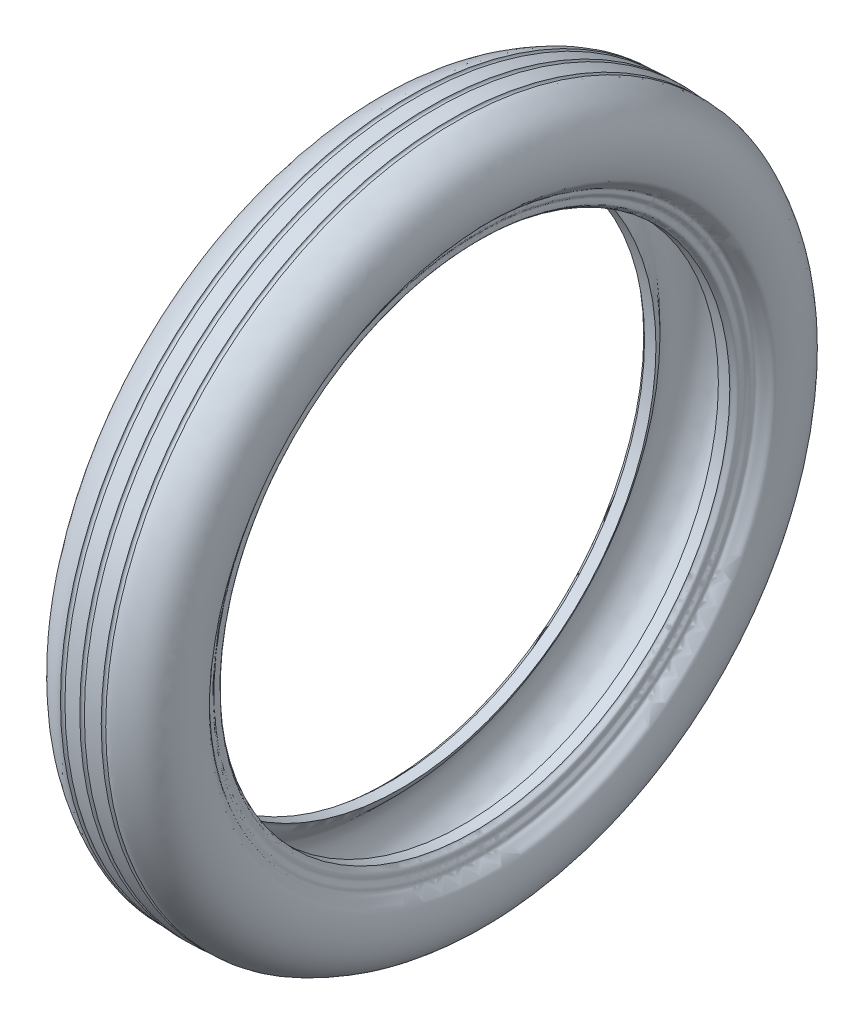
ISO-10303-21;
HEADER;
FILE_DESCRIPTION(('STEP AP214'),'2;1');
FILE_NAME('part.step','',(''),(''),'','','');
FILE_SCHEMA(('AUTOMOTIVE_DESIGN { 1 0 10303 214 1 1 1 1 }'));
ENDSEC;
DATA;
#1=APPLICATION_CONTEXT('core data for automotive mechanical design processes');
#2=APPLICATION_PROTOCOL_DEFINITION('international standard','automotive_design',2000,#1);
#3=PRODUCT_CONTEXT('',#1,'mechanical');
#4=PRODUCT('Part','Part','',(#3));
#5=PRODUCT_RELATED_PRODUCT_CATEGORY('part','',(#4));
#6=PRODUCT_DEFINITION_FORMATION('','',#4);
#7=PRODUCT_DEFINITION_CONTEXT('part definition',#1,'design');
#8=PRODUCT_DEFINITION('design','',#6,#7);
#9=PRODUCT_DEFINITION_SHAPE('','',#8);
#10=(LENGTH_UNIT() NAMED_UNIT(*) SI_UNIT(.MILLI.,.METRE.));
#11=(NAMED_UNIT(*) PLANE_ANGLE_UNIT() SI_UNIT($,.RADIAN.));
#12=(NAMED_UNIT(*) SI_UNIT($,.STERADIAN.) SOLID_ANGLE_UNIT());
#13=UNCERTAINTY_MEASURE_WITH_UNIT(LENGTH_MEASURE(1.E-05),#10,'distance_accuracy_value','');
#14=(GEOMETRIC_REPRESENTATION_CONTEXT(3) GLOBAL_UNCERTAINTY_ASSIGNED_CONTEXT((#13)) GLOBAL_UNIT_ASSIGNED_CONTEXT((#10,
#11,#12)) REPRESENTATION_CONTEXT('',''));
#15=CARTESIAN_POINT('',(0.,0.,0.));
#16=DIRECTION('',(0.,0.,1.));
#17=DIRECTION('',(1.,0.,0.));
#18=AXIS2_PLACEMENT_3D('',#15,#16,#17);
#19=CARTESIAN_POINT('',(-24.8172630139917,203.,0.));
#20=CARTESIAN_POINT('',(-27.2283998288289,205.06391431928,0.));
#21=CARTESIAN_POINT('',(-28.5496427344952,210.327625908058,0.));
#22=CARTESIAN_POINT('',(-33.6712545353592,215.019378984169,0.));
#23=CARTESIAN_POINT('',(-37.7772976660351,219.010363555149,0.));
#24=CARTESIAN_POINT('',(-42.2633577257313,223.062020269606,0.));
#25=CARTESIAN_POINT('',(-45.1671204187017,229.55393791157,0.));
#26=CARTESIAN_POINT('',(-48.0286654197166,236.65779205585,0.));
#27=CARTESIAN_POINT('',(-47.8879674715827,244.882513096217,0.));
#28=CARTESIAN_POINT('',(-46.3948773163548,254.057111445877,0.));
#29=CARTESIAN_POINT('',(-40.3486929351291,261.403587543646,0.));
#30=CARTESIAN_POINT('',(-33.851481321555,268.81086706887,0.));
#31=CARTESIAN_POINT('',(-25.2444175261157,271.404992130535,0.));
#32=CARTESIAN_POINT('',(-16.7423312191855,273.18641912113,0.));
#33=CARTESIAN_POINT('',(-10.1405547550226,273.463220362378,0.));
#34=CARTESIAN_POINT('',(-4.54429512443643,274.014061695448,0.));
#35=CARTESIAN_POINT('',(-1.75340207589833,273.445280920895,0.));
#36=CARTESIAN_POINT('',(0.,273.651830628835,0.));
#37=B_SPLINE_CURVE_WITH_KNOTS('',3,(#19,#20,#21,#22,#23,#24,#25,#26,#27,#28,#29,#30,#31,#32,#33,
#34,#35,#36),.UNSPECIFIED.,.F.,.F.,(4,1,1,1,1,1,1,1,1,1,1,1,1,1,1,4),(0.,0.0822330624444425,
0.137617146698626,0.183009302880853,0.237253629031035,0.297469874379483,0.371716047539101,
0.44060468979368,0.515818013596818,0.616103802574389,0.690267434104086,0.776013817716258,
0.849380324821276,0.924772592656254,0.952990480004338,1.),.UNSPECIFIED.);
#38=CARTESIAN_POINT('',(-102.722911074857,0.,0.));
#39=DIRECTION('',(-1.,0.,0.));
#40=AXIS1_PLACEMENT('',#38,#39);
#41=SURFACE_OF_REVOLUTION('',#37,#40);
#42=CARTESIAN_POINT('',(0.,0.,0.));
#43=DIRECTION('',(1.,0.,0.));
#44=DIRECTION('',(0.,0.,-1.));
#45=AXIS2_PLACEMENT_3D('',#42,#43,#44);
#46=CIRCLE('',#45,273.651830628835);
#47=CARTESIAN_POINT('',(0.,0.,-273.651830628835));
#48=VERTEX_POINT('',#47);
#49=EDGE_CURVE('E10',#48,#48,#46,.T.);
#50=ORIENTED_EDGE('',*,*,#49,.T.);
#51=EDGE_LOOP('',(#50));
#52=FACE_BOUND('',#51,.T.);
#53=CARTESIAN_POINT('',(-24.8172630139917,0.,0.));
#54=DIRECTION('',(1.,0.,0.));
#55=DIRECTION('',(0.,0.,-1.));
#56=AXIS2_PLACEMENT_3D('',#53,#54,#55);
#57=CIRCLE('',#56,203.);
#58=CARTESIAN_POINT('',(-24.8172630139917,0.,-203.));
#59=VERTEX_POINT('',#58);
#60=EDGE_CURVE('E73',#59,#59,#57,.T.);
#61=ORIENTED_EDGE('',*,*,#60,.F.);
#62=EDGE_LOOP('',(#61));
#63=FACE_BOUND('',#62,.T.);
#64=ADVANCED_FACE('F35',(#52,#63),#41,.T.);
#65=CARTESIAN_POINT('',(0.,273.651830628835,0.));
#66=CARTESIAN_POINT('',(1.7534020758983,273.445280920895,0.));
#67=CARTESIAN_POINT('',(4.5442951244364,274.014061695448,0.));
#68=CARTESIAN_POINT('',(10.1405547550225,273.463220362378,0.));
#69=CARTESIAN_POINT('',(16.7423312191854,273.186419121129,0.));
#70=CARTESIAN_POINT('',(25.2444175261157,271.404992130535,0.));
#71=CARTESIAN_POINT('',(33.851481321555,268.81086706887,0.));
#72=CARTESIAN_POINT('',(40.3486929351291,261.403587543646,0.));
#73=CARTESIAN_POINT('',(46.3948773163547,254.057111445877,0.));
#74=CARTESIAN_POINT('',(47.8879674715826,244.882513096217,0.));
#75=CARTESIAN_POINT('',(48.0286654197166,236.65779205585,0.));
#76=CARTESIAN_POINT('',(45.1671204187017,229.55393791157,0.));
#77=CARTESIAN_POINT('',(42.2633577257312,223.062020269606,0.));
#78=CARTESIAN_POINT('',(37.7772976660351,219.010363555149,0.));
#79=CARTESIAN_POINT('',(33.6712545353592,215.019378984169,0.));
#80=CARTESIAN_POINT('',(28.5496427344952,210.327625908058,0.));
#81=CARTESIAN_POINT('',(27.2283998288289,205.06391431928,0.));
#82=CARTESIAN_POINT('',(24.8172630139916,203.,0.));
#83=B_SPLINE_CURVE_WITH_KNOTS('',3,(#65,#66,#67,#68,#69,#70,#71,#72,#73,#74,#75,#76,#77,#78,#79,
#80,#81,#82),.UNSPECIFIED.,.F.,.F.,(4,1,1,1,1,1,1,1,1,1,1,1,1,1,1,4),(0.,0.0470095199956621,
0.0752274073437459,0.150619675178724,0.223986182283742,0.309732565895914,0.383896197425612,
0.484181986403182,0.55939531020632,0.628283952460899,0.702530125620518,0.762746370968965,
0.816990697119147,0.862382853301374,0.917766937555557,1.),.UNSPECIFIED.);
#84=CARTESIAN_POINT('',(-102.722911074857,0.,0.));
#85=DIRECTION('',(-1.,0.,0.));
#86=AXIS1_PLACEMENT('',#84,#85);
#87=SURFACE_OF_REVOLUTION('',#83,#86);
#88=CARTESIAN_POINT('',(24.8172630139917,0.,0.));
#89=DIRECTION('',(1.,0.,0.));
#90=DIRECTION('',(0.,0.,-1.));
#91=AXIS2_PLACEMENT_3D('',#88,#89,#90);
#92=CIRCLE('',#91,203.);
#93=CARTESIAN_POINT('',(24.8172630139917,0.,-203.));
#94=VERTEX_POINT('',#93);
#95=EDGE_CURVE('E42',#94,#94,#92,.T.);
#96=ORIENTED_EDGE('',*,*,#95,.T.);
#97=EDGE_LOOP('',(#96));
#98=FACE_BOUND('',#97,.T.);
#99=ORIENTED_EDGE('',*,*,#49,.F.);
#100=EDGE_LOOP('',(#99));
#101=FACE_BOUND('',#100,.T.);
#102=ADVANCED_FACE('F120',(#98,#101),#87,.T.);
#103=CARTESIAN_POINT('',(-102.722911074857,0.,0.));
#104=DIRECTION('',(-1.,0.,0.));
#105=DIRECTION('',(0.,0.,-1.));
#106=AXIS2_PLACEMENT_3D('',#103,#104,#105);
#107=CYLINDRICAL_SURFACE('',#106,203.);
#108=CARTESIAN_POINT('',(33.9052748219322,0.,0.));
#109=DIRECTION('',(1.,0.,0.));
#110=DIRECTION('',(0.,0.,-1.));
#111=AXIS2_PLACEMENT_3D('',#108,#109,#110);
#112=CIRCLE('',#111,203.);
#113=CARTESIAN_POINT('',(33.9052748219322,0.,-203.));
#114=VERTEX_POINT('',#113);
#115=EDGE_CURVE('E46',#114,#114,#112,.T.);
#116=ORIENTED_EDGE('',*,*,#115,.T.);
#117=EDGE_LOOP('',(#116));
#118=FACE_BOUND('',#117,.T.);
#119=ORIENTED_EDGE('',*,*,#95,.F.);
#120=EDGE_LOOP('',(#119));
#121=FACE_BOUND('',#120,.T.);
#122=ADVANCED_FACE('F117',(#118,#121),#107,.F.);
#123=CARTESIAN_POINT('',(33.9052748219323,203.,0.));
#124=CARTESIAN_POINT('',(34.4514477122976,204.223315441255,0.));
#125=CARTESIAN_POINT('',(38.405176851135,205.210772848352,0.));
#126=CARTESIAN_POINT('',(37.5895196663085,208.702454770499,0.));
#127=CARTESIAN_POINT('',(37.3176730115443,211.637363166268,0.));
#128=CARTESIAN_POINT('',(40.3679293440638,213.465220786409,0.));
#129=CARTESIAN_POINT('',(39.0660676586276,217.086806756293,0.));
#130=CARTESIAN_POINT('',(42.5299588621192,218.987124675277,0.));
#131=CARTESIAN_POINT('',(44.4812031460707,222.024976144124,0.));
#132=CARTESIAN_POINT('',(48.1613248996428,224.664233070907,0.));
#133=CARTESIAN_POINT('',(49.3373100798012,231.297261903147,0.));
#134=CARTESIAN_POINT('',(50.5659703704679,239.217588361253,0.));
#135=CARTESIAN_POINT('',(49.5419089182548,249.309832870114,0.));
#136=CARTESIAN_POINT('',(46.4257794125868,258.785832909676,0.));
#137=CARTESIAN_POINT('',(40.6849116029119,266.454028141102,0.));
#138=CARTESIAN_POINT('',(33.8688282793654,271.544671240841,0.));
#139=CARTESIAN_POINT('',(26.5848661668035,275.239525498986,0.));
#140=CARTESIAN_POINT('',(21.3849500525043,277.770418692312,0.));
#141=CARTESIAN_POINT('',(18.0012541580362,277.496758701426,0.));
#142=B_SPLINE_CURVE_WITH_KNOTS('',3,(#123,#124,#125,#126,#127,#128,#129,#130,#131,#132,#133,
#134,#135,#136,#137,#138,#139,#140,#141),.UNSPECIFIED.,.F.,.F.,(4,1,1,1,1,1,1,1,1,1,1,1,1,1,1,1,
4),(0.,0.0502849018641816,0.0809639249454713,0.0972057606943899,0.139297033110355,
0.164562110942005,0.195188010133947,0.242420179219544,0.280702553209471,0.328072425704126,
0.440671496514186,0.53314982377352,0.638161135079807,0.746440040072595,0.823682365401741,
0.89958494243369,1.),.UNSPECIFIED.);
#143=CARTESIAN_POINT('',(-102.722911074857,0.,0.));
#144=DIRECTION('',(-1.,0.,0.));
#145=AXIS1_PLACEMENT('',#143,#144);
#146=SURFACE_OF_REVOLUTION('',#142,#145);
#147=CARTESIAN_POINT('',(18.0012541580362,0.,0.));
#148=DIRECTION('',(1.,0.,0.));
#149=DIRECTION('',(0.,0.,-1.));
#150=AXIS2_PLACEMENT_3D('',#147,#148,#149);
#151=CIRCLE('',#150,277.496758701426);
#152=CARTESIAN_POINT('',(18.0012541580362,0.,-277.496758701426));
#153=VERTEX_POINT('',#152);
#154=EDGE_CURVE('E50',#153,#153,#151,.T.);
#155=ORIENTED_EDGE('',*,*,#154,.T.);
#156=EDGE_LOOP('',(#155));
#157=FACE_BOUND('',#156,.T.);
#158=ORIENTED_EDGE('',*,*,#115,.F.);
#159=EDGE_LOOP('',(#158));
#160=FACE_BOUND('',#159,.T.);
#161=ADVANCED_FACE('F113',(#157,#160),#146,.T.);
#162=CARTESIAN_POINT('',(16.2157456896604,0.,0.));
#163=DIRECTION('',(-1.,0.,0.));
#164=DIRECTION('',(0.,0.,-1.));
#165=AXIS2_PLACEMENT_3D('',#162,#163,#164);
#166=TOROIDAL_SURFACE('',#165,277.496758701426,1.7855084683758);
#167=CARTESIAN_POINT('',(14.4302372212846,0.,0.));
#168=DIRECTION('',(1.,0.,0.));
#169=DIRECTION('',(0.,0.,-1.));
#170=AXIS2_PLACEMENT_3D('',#167,#168,#169);
#171=CIRCLE('',#170,277.496758701426);
#172=CARTESIAN_POINT('',(14.4302372212846,0.,-277.496758701426));
#173=VERTEX_POINT('',#172);
#174=EDGE_CURVE('E55',#173,#173,#171,.T.);
#175=ORIENTED_EDGE('',*,*,#174,.T.);
#176=EDGE_LOOP('',(#175));
#177=FACE_BOUND('',#176,.T.);
#178=ORIENTED_EDGE('',*,*,#154,.F.);
#179=EDGE_LOOP('',(#178));
#180=FACE_BOUND('',#179,.T.);
#181=ADVANCED_FACE('F109',(#177,#180),#166,.F.);
#182=CARTESIAN_POINT('',(14.4302372212846,0.,0.));
#183=DIRECTION('',(-1.,0.,0.));
#184=DIRECTION('',(0.,0.,-1.));
#185=AXIS2_PLACEMENT_3D('',#182,#183,#184);
#186=CONICAL_SURFACE('',#185,277.496758701426,0.0638636091062138);
#187=CARTESIAN_POINT('',(1.81905865515339,0.,0.));
#188=DIRECTION('',(1.,0.,0.));
#189=DIRECTION('',(0.,0.,-1.));
#190=AXIS2_PLACEMENT_3D('',#187,#188,#189);
#191=CIRCLE('',#190,278.303250820303);
#192=CARTESIAN_POINT('',(1.81905865515339,0.,-278.303250820303));
#193=VERTEX_POINT('',#192);
#194=EDGE_CURVE('E58',#193,#193,#191,.T.);
#195=ORIENTED_EDGE('',*,*,#194,.T.);
#196=EDGE_LOOP('',(#195));
#197=FACE_BOUND('',#196,.T.);
#198=ORIENTED_EDGE('',*,*,#174,.F.);
#199=EDGE_LOOP('',(#198));
#200=FACE_BOUND('',#199,.T.);
#201=ADVANCED_FACE('F105',(#197,#200),#186,.T.);
#202=CARTESIAN_POINT('',(0.,0.,0.));
#203=DIRECTION('',(-1.,0.,0.));
#204=DIRECTION('',(0.,0.,-1.));
#205=AXIS2_PLACEMENT_3D('',#202,#203,#204);
#206=TOROIDAL_SURFACE('',#205,278.303250820303,1.8190586551534);
#207=CARTESIAN_POINT('',(-1.81905865515342,0.,0.));
#208=DIRECTION('',(1.,0.,0.));
#209=DIRECTION('',(0.,0.,-1.));
#210=AXIS2_PLACEMENT_3D('',#207,#208,#209);
#211=CIRCLE('',#210,278.303250820303);
#212=CARTESIAN_POINT('',(-1.81905865515342,0.,-278.303250820303));
#213=VERTEX_POINT('',#212);
#214=EDGE_CURVE('E61',#213,#213,#211,.T.);
#215=ORIENTED_EDGE('',*,*,#214,.T.);
#216=EDGE_LOOP('',(#215));
#217=FACE_BOUND('',#216,.T.);
#218=ORIENTED_EDGE('',*,*,#194,.F.);
#219=EDGE_LOOP('',(#218));
#220=FACE_BOUND('',#219,.T.);
#221=ADVANCED_FACE('F101',(#217,#220),#206,.F.);
#222=CARTESIAN_POINT('',(-1.81905865515342,0.,0.));
#223=DIRECTION('',(1.,0.,0.));
#224=DIRECTION('',(0.,0.,1.));
#225=AXIS2_PLACEMENT_3D('',#222,#223,#224);
#226=CONICAL_SURFACE('',#225,278.303250820303,0.0638636091062136);
#227=CARTESIAN_POINT('',(-14.4302372212846,0.,0.));
#228=DIRECTION('',(1.,0.,0.));
#229=DIRECTION('',(0.,0.,-1.));
#230=AXIS2_PLACEMENT_3D('',#227,#228,#229);
#231=CIRCLE('',#230,277.496758701426);
#232=CARTESIAN_POINT('',(-14.4302372212846,0.,-277.496758701426));
#233=VERTEX_POINT('',#232);
#234=EDGE_CURVE('E64',#233,#233,#231,.T.);
#235=ORIENTED_EDGE('',*,*,#234,.T.);
#236=EDGE_LOOP('',(#235));
#237=FACE_BOUND('',#236,.T.);
#238=ORIENTED_EDGE('',*,*,#214,.F.);
#239=EDGE_LOOP('',(#238));
#240=FACE_BOUND('',#239,.T.);
#241=ADVANCED_FACE('F97',(#237,#240),#226,.T.);
#242=CARTESIAN_POINT('',(-16.2157456896604,0.,0.));
#243=DIRECTION('',(-1.,0.,0.));
#244=DIRECTION('',(0.,0.,-1.));
#245=AXIS2_PLACEMENT_3D('',#242,#243,#244);
#246=TOROIDAL_SURFACE('',#245,277.496758701426,1.78550846837579);
#247=CARTESIAN_POINT('',(-18.0012541580362,0.,0.));
#248=DIRECTION('',(1.,0.,0.));
#249=DIRECTION('',(0.,0.,-1.));
#250=AXIS2_PLACEMENT_3D('',#247,#248,#249);
#251=CIRCLE('',#250,277.496758701426);
#252=CARTESIAN_POINT('',(-18.0012541580362,0.,-277.496758701426));
#253=VERTEX_POINT('',#252);
#254=EDGE_CURVE('E67',#253,#253,#251,.T.);
#255=ORIENTED_EDGE('',*,*,#254,.T.);
#256=EDGE_LOOP('',(#255));
#257=FACE_BOUND('',#256,.T.);
#258=ORIENTED_EDGE('',*,*,#234,.F.);
#259=EDGE_LOOP('',(#258));
#260=FACE_BOUND('',#259,.T.);
#261=ADVANCED_FACE('F93',(#257,#260),#246,.F.);
#262=CARTESIAN_POINT('',(-18.0012541580362,277.496758701426,0.));
#263=CARTESIAN_POINT('',(-21.3849500525043,277.770418692312,0.));
#264=CARTESIAN_POINT('',(-26.5848661668036,275.239525498986,0.));
#265=CARTESIAN_POINT('',(-33.8688282793654,271.544671240841,0.));
#266=CARTESIAN_POINT('',(-40.6849116029119,266.454028141102,0.));
#267=CARTESIAN_POINT('',(-46.4257794125868,258.785832909676,0.));
#268=CARTESIAN_POINT('',(-49.5419089182548,249.309832870114,0.));
#269=CARTESIAN_POINT('',(-50.5659703704679,239.217588361253,0.));
#270=CARTESIAN_POINT('',(-49.3373100798012,231.297261903147,0.));
#271=CARTESIAN_POINT('',(-48.1613248996428,224.664233070907,0.));
#272=CARTESIAN_POINT('',(-44.4812031460707,222.024976144124,0.));
#273=CARTESIAN_POINT('',(-42.5299588621193,218.987124675277,0.));
#274=CARTESIAN_POINT('',(-39.0660676586276,217.086806756293,0.));
#275=CARTESIAN_POINT('',(-40.3679293440638,213.465220786409,0.));
#276=CARTESIAN_POINT('',(-37.3176730115443,211.637363166268,0.));
#277=CARTESIAN_POINT('',(-37.5895196663085,208.702454770499,0.));
#278=CARTESIAN_POINT('',(-38.405176851135,205.210772848352,0.));
#279=CARTESIAN_POINT('',(-34.4514477122976,204.223315441255,0.));
#280=CARTESIAN_POINT('',(-33.9052748219323,203.,0.));
#281=B_SPLINE_CURVE_WITH_KNOTS('',3,(#262,#263,#264,#265,#266,#267,#268,#269,#270,#271,#272,
#273,#274,#275,#276,#277,#278,#279,#280),.UNSPECIFIED.,.F.,.F.,(4,1,1,1,1,1,1,1,1,1,1,1,1,1,1,1,
4),(0.,0.10041505756631,0.176317634598259,0.253559959927405,0.361838864920193,0.46685017622648,
0.559328503485814,0.671927574295874,0.719297446790528,0.757579820780456,0.804811989866053,
0.835437889057995,0.860702966889645,0.90279423930561,0.919036075054529,0.949715098135818,1.),.UNSPECIFIED.);
#282=CARTESIAN_POINT('',(-102.722911074857,0.,0.));
#283=DIRECTION('',(-1.,0.,0.));
#284=AXIS1_PLACEMENT('',#282,#283);
#285=SURFACE_OF_REVOLUTION('',#281,#284);
#286=CARTESIAN_POINT('',(-33.9052748219323,0.,0.));
#287=DIRECTION('',(1.,0.,0.));
#288=DIRECTION('',(0.,0.,-1.));
#289=AXIS2_PLACEMENT_3D('',#286,#287,#288);
#290=CIRCLE('',#289,203.);
#291=CARTESIAN_POINT('',(-33.9052748219323,0.,-203.));
#292=VERTEX_POINT('',#291);
#293=EDGE_CURVE('E70',#292,#292,#290,.T.);
#294=ORIENTED_EDGE('',*,*,#293,.T.);
#295=EDGE_LOOP('',(#294));
#296=FACE_BOUND('',#295,.T.);
#297=ORIENTED_EDGE('',*,*,#254,.F.);
#298=EDGE_LOOP('',(#297));
#299=FACE_BOUND('',#298,.T.);
#300=ADVANCED_FACE('F88',(#296,#299),#285,.T.);
#301=CARTESIAN_POINT('',(-102.722911074857,0.,0.));
#302=DIRECTION('',(-1.,0.,0.));
#303=DIRECTION('',(0.,0.,-1.));
#304=AXIS2_PLACEMENT_3D('',#301,#302,#303);
#305=CYLINDRICAL_SURFACE('',#304,203.);
#306=ORIENTED_EDGE('',*,*,#60,.T.);
#307=EDGE_LOOP('',(#306));
#308=FACE_BOUND('',#307,.T.);
#309=ORIENTED_EDGE('',*,*,#293,.F.);
#310=EDGE_LOOP('',(#309));
#311=FACE_BOUND('',#310,.T.);
#312=ADVANCED_FACE('F92',(#308,#311),#305,.F.);
#313=CLOSED_SHELL('',(#64,#102,#122,#161,#181,#201,#221,#241,#261,#300,#312));
#314=MANIFOLD_SOLID_BREP('B2',#313);
#315=ADVANCED_BREP_SHAPE_REPRESENTATION('',(#18,#314),#14);
#316=SHAPE_DEFINITION_REPRESENTATION(#9,#315);
ENDSEC;
END-ISO-10303-21;
